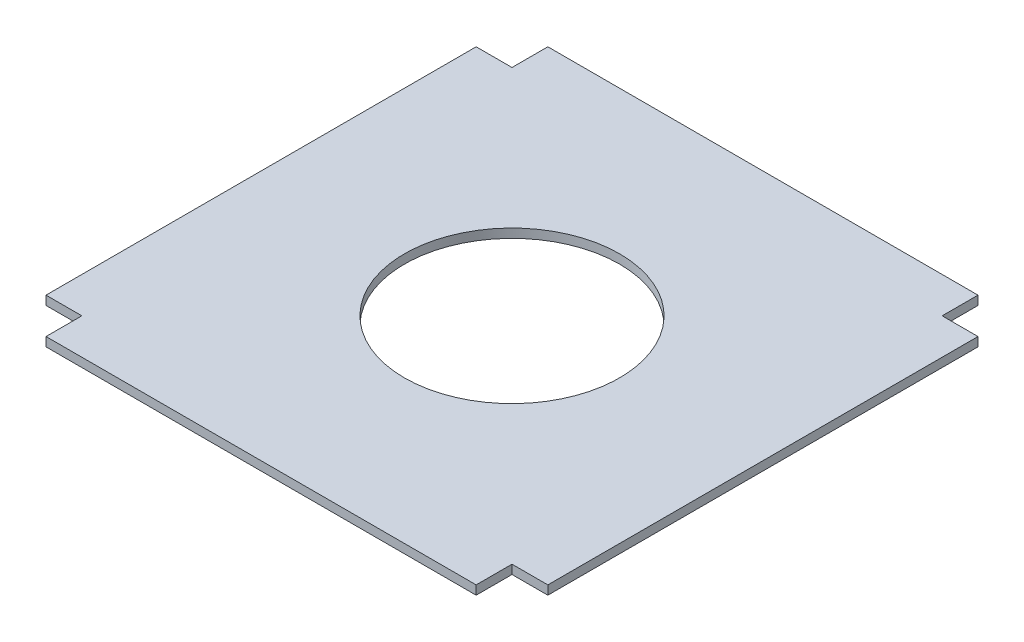
ISO-10303-21;
HEADER;
FILE_DESCRIPTION(('STEP AP214'),'2;1');
FILE_NAME('part.step','',(''),(''),'','','');
FILE_SCHEMA(('AUTOMOTIVE_DESIGN { 1 0 10303 214 1 1 1 1 }'));
ENDSEC;
DATA;
#1=APPLICATION_CONTEXT('core data for automotive mechanical design processes');
#2=APPLICATION_PROTOCOL_DEFINITION('international standard','automotive_design',2000,#1);
#3=PRODUCT_CONTEXT('',#1,'mechanical');
#4=PRODUCT('Part','Part','',(#3));
#5=PRODUCT_RELATED_PRODUCT_CATEGORY('part','',(#4));
#6=PRODUCT_DEFINITION_FORMATION('','',#4);
#7=PRODUCT_DEFINITION_CONTEXT('part definition',#1,'design');
#8=PRODUCT_DEFINITION('design','',#6,#7);
#9=PRODUCT_DEFINITION_SHAPE('','',#8);
#10=(LENGTH_UNIT() NAMED_UNIT(*) SI_UNIT(.MILLI.,.METRE.));
#11=(NAMED_UNIT(*) PLANE_ANGLE_UNIT() SI_UNIT($,.RADIAN.));
#12=(NAMED_UNIT(*) SI_UNIT($,.STERADIAN.) SOLID_ANGLE_UNIT());
#13=UNCERTAINTY_MEASURE_WITH_UNIT(LENGTH_MEASURE(1.E-05),#10,'distance_accuracy_value','');
#14=(GEOMETRIC_REPRESENTATION_CONTEXT(3) GLOBAL_UNCERTAINTY_ASSIGNED_CONTEXT((#13)) GLOBAL_UNIT_ASSIGNED_CONTEXT((#10,
#11,#12)) REPRESENTATION_CONTEXT('',''));
#15=CARTESIAN_POINT('',(0.,0.,0.));
#16=DIRECTION('',(0.,0.,1.));
#17=DIRECTION('',(1.,0.,0.));
#18=AXIS2_PLACEMENT_3D('',#15,#16,#17);
#19=CARTESIAN_POINT('',(0.,6.35,0.));
#20=DIRECTION('',(0.,1.,0.));
#21=DIRECTION('',(0.,0.,1.));
#22=AXIS2_PLACEMENT_3D('',#19,#20,#21);
#23=PLANE('',#22);
#24=DIRECTION('',(1.,0.,0.));
#25=VECTOR('',#24,1.);
#26=CARTESIAN_POINT('',(25.4,6.35,0.));
#27=LINE('',#26,#25);
#28=CARTESIAN_POINT('',(0.,6.35,0.));
#29=VERTEX_POINT('',#28);
#30=CARTESIAN_POINT('',(25.4,6.35,0.));
#31=VERTEX_POINT('',#30);
#32=EDGE_CURVE('E200',#29,#31,#27,.T.);
#33=ORIENTED_EDGE('',*,*,#32,.T.);
#34=DIRECTION('',(0.,0.,-1.));
#35=VECTOR('',#34,1.);
#36=CARTESIAN_POINT('',(25.4,6.35,-304.8));
#37=LINE('',#36,#35);
#38=CARTESIAN_POINT('',(25.4,6.35,-304.8));
#39=VERTEX_POINT('',#38);
#40=EDGE_CURVE('E112',#31,#39,#37,.T.);
#41=ORIENTED_EDGE('',*,*,#40,.T.);
#42=DIRECTION('',(-1.,0.,0.));
#43=VECTOR('',#42,1.);
#44=CARTESIAN_POINT('',(0.,6.35,-304.8));
#45=LINE('',#44,#43);
#46=CARTESIAN_POINT('',(0.,6.35,-304.8));
#47=VERTEX_POINT('',#46);
#48=EDGE_CURVE('E237',#39,#47,#45,.T.);
#49=ORIENTED_EDGE('',*,*,#48,.T.);
#50=DIRECTION('',(0.,0.,-1.));
#51=VECTOR('',#50,1.);
#52=CARTESIAN_POINT('',(0.,6.35,-330.2));
#53=LINE('',#52,#51);
#54=CARTESIAN_POINT('',(0.,6.35,-330.2));
#55=VERTEX_POINT('',#54);
#56=EDGE_CURVE('E257',#47,#55,#53,.T.);
#57=ORIENTED_EDGE('',*,*,#56,.T.);
#58=DIRECTION('',(-1.,0.,0.));
#59=VECTOR('',#58,1.);
#60=CARTESIAN_POINT('',(-304.8,6.35,-330.2));
#61=LINE('',#60,#59);
#62=CARTESIAN_POINT('',(-304.8,6.35,-330.2));
#63=VERTEX_POINT('',#62);
#64=EDGE_CURVE('E253',#55,#63,#61,.T.);
#65=ORIENTED_EDGE('',*,*,#64,.T.);
#66=DIRECTION('',(0.,0.,1.));
#67=VECTOR('',#66,1.);
#68=CARTESIAN_POINT('',(-304.8,6.35,-304.8));
#69=LINE('',#68,#67);
#70=CARTESIAN_POINT('',(-304.8,6.35,-304.8));
#71=VERTEX_POINT('',#70);
#72=EDGE_CURVE('E256',#63,#71,#69,.T.);
#73=ORIENTED_EDGE('',*,*,#72,.T.);
#74=DIRECTION('',(-1.,0.,0.));
#75=VECTOR('',#74,1.);
#76=CARTESIAN_POINT('',(-330.2,6.35,-304.8));
#77=LINE('',#76,#75);
#78=CARTESIAN_POINT('',(-330.2,6.35,-304.8));
#79=VERTEX_POINT('',#78);
#80=EDGE_CURVE('E261',#71,#79,#77,.T.);
#81=ORIENTED_EDGE('',*,*,#80,.T.);
#82=DIRECTION('',(0.,0.,1.));
#83=VECTOR('',#82,1.);
#84=CARTESIAN_POINT('',(-330.2,6.35,0.));
#85=LINE('',#84,#83);
#86=CARTESIAN_POINT('',(-330.2,6.35,0.));
#87=VERTEX_POINT('',#86);
#88=EDGE_CURVE('E268',#79,#87,#85,.T.);
#89=ORIENTED_EDGE('',*,*,#88,.T.);
#90=DIRECTION('',(1.,0.,0.));
#91=VECTOR('',#90,1.);
#92=CARTESIAN_POINT('',(-304.8,6.35,0.));
#93=LINE('',#92,#91);
#94=CARTESIAN_POINT('',(-304.8,6.35,0.));
#95=VERTEX_POINT('',#94);
#96=EDGE_CURVE('E143',#87,#95,#93,.T.);
#97=ORIENTED_EDGE('',*,*,#96,.T.);
#98=DIRECTION('',(0.,0.,1.));
#99=VECTOR('',#98,1.);
#100=CARTESIAN_POINT('',(-304.8,6.35,25.4));
#101=LINE('',#100,#99);
#102=CARTESIAN_POINT('',(-304.8,6.35,25.4));
#103=VERTEX_POINT('',#102);
#104=EDGE_CURVE('E137',#95,#103,#101,.T.);
#105=ORIENTED_EDGE('',*,*,#104,.T.);
#106=DIRECTION('',(1.,0.,0.));
#107=VECTOR('',#106,1.);
#108=CARTESIAN_POINT('',(0.,6.35,25.4));
#109=LINE('',#108,#107);
#110=CARTESIAN_POINT('',(0.,6.35,25.4));
#111=VERTEX_POINT('',#110);
#112=EDGE_CURVE('E141',#103,#111,#109,.T.);
#113=ORIENTED_EDGE('',*,*,#112,.T.);
#114=DIRECTION('',(0.,0.,-1.));
#115=VECTOR('',#114,1.);
#116=CARTESIAN_POINT('',(0.,6.35,0.));
#117=LINE('',#116,#115);
#118=EDGE_CURVE('E57',#111,#29,#117,.T.);
#119=ORIENTED_EDGE('',*,*,#118,.T.);
#120=EDGE_LOOP('',(#33,#41,#49,#57,#65,#73,#81,#89,#97,#105,#113,#119));
#121=FACE_BOUND('',#120,.T.);
#122=CARTESIAN_POINT('',(-152.4,6.35,-152.4));
#123=DIRECTION('',(0.,1.,0.));
#124=DIRECTION('',(0.,0.,1.));
#125=AXIS2_PLACEMENT_3D('',#122,#123,#124);
#126=CIRCLE('',#125,76.2);
#127=CARTESIAN_POINT('',(-152.4,6.35,-76.2));
#128=VERTEX_POINT('',#127);
#129=EDGE_CURVE('E170',#128,#128,#126,.T.);
#130=ORIENTED_EDGE('',*,*,#129,.F.);
#131=EDGE_LOOP('',(#130));
#132=FACE_BOUND('',#131,.T.);
#133=ADVANCED_FACE('F39',(#121,#132),#23,.T.);
#134=CARTESIAN_POINT('',(0.,0.,0.));
#135=DIRECTION('',(0.,1.,0.));
#136=DIRECTION('',(0.,0.,1.));
#137=AXIS2_PLACEMENT_3D('',#134,#135,#136);
#138=PLANE('',#137);
#139=DIRECTION('',(1.,0.,0.));
#140=VECTOR('',#139,1.);
#141=CARTESIAN_POINT('',(25.4,0.,0.));
#142=LINE('',#141,#140);
#143=CARTESIAN_POINT('',(0.,0.,0.));
#144=VERTEX_POINT('',#143);
#145=CARTESIAN_POINT('',(25.4,0.,0.));
#146=VERTEX_POINT('',#145);
#147=EDGE_CURVE('E165',#144,#146,#142,.T.);
#148=ORIENTED_EDGE('',*,*,#147,.F.);
#149=DIRECTION('',(0.,0.,-1.));
#150=VECTOR('',#149,1.);
#151=CARTESIAN_POINT('',(0.,0.,0.));
#152=LINE('',#151,#150);
#153=CARTESIAN_POINT('',(0.,0.,25.4));
#154=VERTEX_POINT('',#153);
#155=EDGE_CURVE('E104',#154,#144,#152,.T.);
#156=ORIENTED_EDGE('',*,*,#155,.F.);
#157=DIRECTION('',(1.,0.,0.));
#158=VECTOR('',#157,1.);
#159=CARTESIAN_POINT('',(0.,0.,25.4));
#160=LINE('',#159,#158);
#161=CARTESIAN_POINT('',(-304.8,0.,25.4));
#162=VERTEX_POINT('',#161);
#163=EDGE_CURVE('E98',#162,#154,#160,.T.);
#164=ORIENTED_EDGE('',*,*,#163,.F.);
#165=DIRECTION('',(0.,0.,1.));
#166=VECTOR('',#165,1.);
#167=CARTESIAN_POINT('',(-304.8,0.,25.4));
#168=LINE('',#167,#166);
#169=CARTESIAN_POINT('',(-304.8,0.,0.));
#170=VERTEX_POINT('',#169);
#171=EDGE_CURVE('E152',#170,#162,#168,.T.);
#172=ORIENTED_EDGE('',*,*,#171,.F.);
#173=DIRECTION('',(1.,0.,0.));
#174=VECTOR('',#173,1.);
#175=CARTESIAN_POINT('',(-304.8,0.,0.));
#176=LINE('',#175,#174);
#177=CARTESIAN_POINT('',(-330.2,0.,0.));
#178=VERTEX_POINT('',#177);
#179=EDGE_CURVE('E191',#178,#170,#176,.T.);
#180=ORIENTED_EDGE('',*,*,#179,.F.);
#181=DIRECTION('',(0.,0.,1.));
#182=VECTOR('',#181,1.);
#183=CARTESIAN_POINT('',(-330.2,0.,0.));
#184=LINE('',#183,#182);
#185=CARTESIAN_POINT('',(-330.2,0.,-304.8));
#186=VERTEX_POINT('',#185);
#187=EDGE_CURVE('E188',#186,#178,#184,.T.);
#188=ORIENTED_EDGE('',*,*,#187,.F.);
#189=DIRECTION('',(-1.,0.,0.));
#190=VECTOR('',#189,1.);
#191=CARTESIAN_POINT('',(-330.2,0.,-304.8));
#192=LINE('',#191,#190);
#193=CARTESIAN_POINT('',(-304.8,0.,-304.8));
#194=VERTEX_POINT('',#193);
#195=EDGE_CURVE('E185',#194,#186,#192,.T.);
#196=ORIENTED_EDGE('',*,*,#195,.F.);
#197=DIRECTION('',(0.,0.,1.));
#198=VECTOR('',#197,1.);
#199=CARTESIAN_POINT('',(-304.8,0.,-304.8));
#200=LINE('',#199,#198);
#201=CARTESIAN_POINT('',(-304.8,0.,-330.2));
#202=VERTEX_POINT('',#201);
#203=EDGE_CURVE('E182',#202,#194,#200,.T.);
#204=ORIENTED_EDGE('',*,*,#203,.F.);
#205=DIRECTION('',(-1.,0.,0.));
#206=VECTOR('',#205,1.);
#207=CARTESIAN_POINT('',(-304.8,0.,-330.2));
#208=LINE('',#207,#206);
#209=CARTESIAN_POINT('',(0.,0.,-330.2));
#210=VERTEX_POINT('',#209);
#211=EDGE_CURVE('E179',#210,#202,#208,.T.);
#212=ORIENTED_EDGE('',*,*,#211,.F.);
#213=DIRECTION('',(0.,0.,-1.));
#214=VECTOR('',#213,1.);
#215=CARTESIAN_POINT('',(0.,0.,-330.2));
#216=LINE('',#215,#214);
#217=CARTESIAN_POINT('',(0.,0.,-304.8));
#218=VERTEX_POINT('',#217);
#219=EDGE_CURVE('E176',#218,#210,#216,.T.);
#220=ORIENTED_EDGE('',*,*,#219,.F.);
#221=DIRECTION('',(-1.,0.,0.));
#222=VECTOR('',#221,1.);
#223=CARTESIAN_POINT('',(0.,0.,-304.8));
#224=LINE('',#223,#222);
#225=CARTESIAN_POINT('',(25.4,0.,-304.8));
#226=VERTEX_POINT('',#225);
#227=EDGE_CURVE('E173',#226,#218,#224,.T.);
#228=ORIENTED_EDGE('',*,*,#227,.F.);
#229=DIRECTION('',(0.,0.,-1.));
#230=VECTOR('',#229,1.);
#231=CARTESIAN_POINT('',(25.4,0.,-304.8));
#232=LINE('',#231,#230);
#233=EDGE_CURVE('E169',#146,#226,#232,.T.);
#234=ORIENTED_EDGE('',*,*,#233,.F.);
#235=EDGE_LOOP('',(#148,#156,#164,#172,#180,#188,#196,#204,#212,#220,#228,#234));
#236=FACE_BOUND('',#235,.T.);
#237=CARTESIAN_POINT('',(-152.4,0.,-152.4));
#238=DIRECTION('',(0.,1.,0.));
#239=DIRECTION('',(0.,0.,1.));
#240=AXIS2_PLACEMENT_3D('',#237,#238,#239);
#241=CIRCLE('',#240,76.2);
#242=CARTESIAN_POINT('',(-152.4,0.,-76.2));
#243=VERTEX_POINT('',#242);
#244=EDGE_CURVE('E417',#243,#243,#241,.T.);
#245=ORIENTED_EDGE('',*,*,#244,.T.);
#246=EDGE_LOOP('',(#245));
#247=FACE_BOUND('',#246,.T.);
#248=ADVANCED_FACE('F241',(#236,#247),#138,.F.);
#249=CARTESIAN_POINT('',(25.4,6.35,0.));
#250=DIRECTION('',(0.,0.,-1.));
#251=DIRECTION('',(-1.,0.,0.));
#252=AXIS2_PLACEMENT_3D('',#249,#250,#251);
#253=PLANE('',#252);
#254=ORIENTED_EDGE('',*,*,#147,.T.);
#255=DIRECTION('',(0.,-1.,0.));
#256=VECTOR('',#255,1.);
#257=CARTESIAN_POINT('',(25.4,6.35,0.));
#258=LINE('',#257,#256);
#259=EDGE_CURVE('E11',#31,#146,#258,.T.);
#260=ORIENTED_EDGE('',*,*,#259,.F.);
#261=ORIENTED_EDGE('',*,*,#32,.F.);
#262=DIRECTION('',(0.,-1.,0.));
#263=VECTOR('',#262,1.);
#264=CARTESIAN_POINT('',(0.,6.35,0.));
#265=LINE('',#264,#263);
#266=EDGE_CURVE('E161',#29,#144,#265,.T.);
#267=ORIENTED_EDGE('',*,*,#266,.T.);
#268=EDGE_LOOP('',(#254,#260,#261,#267));
#269=FACE_BOUND('',#268,.T.);
#270=ADVANCED_FACE('F41',(#269),#253,.F.);
#271=CARTESIAN_POINT('',(25.4,6.35,-304.8));
#272=DIRECTION('',(-1.,0.,0.));
#273=DIRECTION('',(0.,0.,1.));
#274=AXIS2_PLACEMENT_3D('',#271,#272,#273);
#275=PLANE('',#274);
#276=ORIENTED_EDGE('',*,*,#233,.T.);
#277=DIRECTION('',(0.,-1.,0.));
#278=VECTOR('',#277,1.);
#279=CARTESIAN_POINT('',(25.4,6.35,-304.8));
#280=LINE('',#279,#278);
#281=EDGE_CURVE('E49',#39,#226,#280,.T.);
#282=ORIENTED_EDGE('',*,*,#281,.F.);
#283=ORIENTED_EDGE('',*,*,#40,.F.);
#284=ORIENTED_EDGE('',*,*,#259,.T.);
#285=EDGE_LOOP('',(#276,#282,#283,#284));
#286=FACE_BOUND('',#285,.T.);
#287=ADVANCED_FACE('F304',(#286),#275,.F.);
#288=CARTESIAN_POINT('',(0.,6.35,-304.8));
#289=DIRECTION('',(0.,0.,1.));
#290=DIRECTION('',(1.,0.,0.));
#291=AXIS2_PLACEMENT_3D('',#288,#289,#290);
#292=PLANE('',#291);
#293=ORIENTED_EDGE('',*,*,#227,.T.);
#294=DIRECTION('',(0.,-1.,0.));
#295=VECTOR('',#294,1.);
#296=CARTESIAN_POINT('',(0.,6.35,-304.8));
#297=LINE('',#296,#295);
#298=EDGE_CURVE('E227',#47,#218,#297,.T.);
#299=ORIENTED_EDGE('',*,*,#298,.F.);
#300=ORIENTED_EDGE('',*,*,#48,.F.);
#301=ORIENTED_EDGE('',*,*,#281,.T.);
#302=EDGE_LOOP('',(#293,#299,#300,#301));
#303=FACE_BOUND('',#302,.T.);
#304=ADVANCED_FACE('F235',(#303),#292,.F.);
#305=CARTESIAN_POINT('',(0.,6.35,-330.2));
#306=DIRECTION('',(-1.,0.,0.));
#307=DIRECTION('',(0.,0.,1.));
#308=AXIS2_PLACEMENT_3D('',#305,#306,#307);
#309=PLANE('',#308);
#310=ORIENTED_EDGE('',*,*,#219,.T.);
#311=DIRECTION('',(0.,-1.,0.));
#312=VECTOR('',#311,1.);
#313=CARTESIAN_POINT('',(0.,6.35,-330.2));
#314=LINE('',#313,#312);
#315=EDGE_CURVE('E223',#55,#210,#314,.T.);
#316=ORIENTED_EDGE('',*,*,#315,.F.);
#317=ORIENTED_EDGE('',*,*,#56,.F.);
#318=ORIENTED_EDGE('',*,*,#298,.T.);
#319=EDGE_LOOP('',(#310,#316,#317,#318));
#320=FACE_BOUND('',#319,.T.);
#321=ADVANCED_FACE('F247',(#320),#309,.F.);
#322=CARTESIAN_POINT('',(-304.8,6.35,-330.2));
#323=DIRECTION('',(0.,0.,1.));
#324=DIRECTION('',(1.,0.,0.));
#325=AXIS2_PLACEMENT_3D('',#322,#323,#324);
#326=PLANE('',#325);
#327=ORIENTED_EDGE('',*,*,#211,.T.);
#328=DIRECTION('',(0.,-1.,0.));
#329=VECTOR('',#328,1.);
#330=CARTESIAN_POINT('',(-304.8,6.35,-330.2));
#331=LINE('',#330,#329);
#332=EDGE_CURVE('E219',#63,#202,#331,.T.);
#333=ORIENTED_EDGE('',*,*,#332,.F.);
#334=ORIENTED_EDGE('',*,*,#64,.F.);
#335=ORIENTED_EDGE('',*,*,#315,.T.);
#336=EDGE_LOOP('',(#327,#333,#334,#335));
#337=FACE_BOUND('',#336,.T.);
#338=ADVANCED_FACE('F251',(#337),#326,.F.);
#339=CARTESIAN_POINT('',(-304.8,6.35,-304.8));
#340=DIRECTION('',(1.,0.,0.));
#341=DIRECTION('',(0.,0.,-1.));
#342=AXIS2_PLACEMENT_3D('',#339,#340,#341);
#343=PLANE('',#342);
#344=ORIENTED_EDGE('',*,*,#203,.T.);
#345=DIRECTION('',(0.,-1.,0.));
#346=VECTOR('',#345,1.);
#347=CARTESIAN_POINT('',(-304.8,6.35,-304.8));
#348=LINE('',#347,#346);
#349=EDGE_CURVE('E215',#71,#194,#348,.T.);
#350=ORIENTED_EDGE('',*,*,#349,.F.);
#351=ORIENTED_EDGE('',*,*,#72,.F.);
#352=ORIENTED_EDGE('',*,*,#332,.T.);
#353=EDGE_LOOP('',(#344,#350,#351,#352));
#354=FACE_BOUND('',#353,.T.);
#355=ADVANCED_FACE('F317',(#354),#343,.F.);
#356=CARTESIAN_POINT('',(-330.2,6.35,-304.8));
#357=DIRECTION('',(0.,0.,1.));
#358=DIRECTION('',(1.,0.,0.));
#359=AXIS2_PLACEMENT_3D('',#356,#357,#358);
#360=PLANE('',#359);
#361=ORIENTED_EDGE('',*,*,#195,.T.);
#362=DIRECTION('',(0.,-1.,0.));
#363=VECTOR('',#362,1.);
#364=CARTESIAN_POINT('',(-330.2,6.35,-304.8));
#365=LINE('',#364,#363);
#366=EDGE_CURVE('E211',#79,#186,#365,.T.);
#367=ORIENTED_EDGE('',*,*,#366,.F.);
#368=ORIENTED_EDGE('',*,*,#80,.F.);
#369=ORIENTED_EDGE('',*,*,#349,.T.);
#370=EDGE_LOOP('',(#361,#367,#368,#369));
#371=FACE_BOUND('',#370,.T.);
#372=ADVANCED_FACE('F320',(#371),#360,.F.);
#373=CARTESIAN_POINT('',(-330.2,6.35,0.));
#374=DIRECTION('',(1.,0.,0.));
#375=DIRECTION('',(0.,0.,-1.));
#376=AXIS2_PLACEMENT_3D('',#373,#374,#375);
#377=PLANE('',#376);
#378=ORIENTED_EDGE('',*,*,#187,.T.);
#379=DIRECTION('',(0.,-1.,0.));
#380=VECTOR('',#379,1.);
#381=CARTESIAN_POINT('',(-330.2,6.35,0.));
#382=LINE('',#381,#380);
#383=EDGE_CURVE('E207',#87,#178,#382,.T.);
#384=ORIENTED_EDGE('',*,*,#383,.F.);
#385=ORIENTED_EDGE('',*,*,#88,.F.);
#386=ORIENTED_EDGE('',*,*,#366,.T.);
#387=EDGE_LOOP('',(#378,#384,#385,#386));
#388=FACE_BOUND('',#387,.T.);
#389=ADVANCED_FACE('F276',(#388),#377,.F.);
#390=CARTESIAN_POINT('',(-304.8,6.35,0.));
#391=DIRECTION('',(0.,0.,-1.));
#392=DIRECTION('',(-1.,0.,0.));
#393=AXIS2_PLACEMENT_3D('',#390,#391,#392);
#394=PLANE('',#393);
#395=ORIENTED_EDGE('',*,*,#179,.T.);
#396=DIRECTION('',(0.,-1.,0.));
#397=VECTOR('',#396,1.);
#398=CARTESIAN_POINT('',(-304.8,6.35,0.));
#399=LINE('',#398,#397);
#400=EDGE_CURVE('E154',#95,#170,#399,.T.);
#401=ORIENTED_EDGE('',*,*,#400,.F.);
#402=ORIENTED_EDGE('',*,*,#96,.F.);
#403=ORIENTED_EDGE('',*,*,#383,.T.);
#404=EDGE_LOOP('',(#395,#401,#402,#403));
#405=FACE_BOUND('',#404,.T.);
#406=ADVANCED_FACE('F280',(#405),#394,.F.);
#407=CARTESIAN_POINT('',(-304.8,6.35,25.4));
#408=DIRECTION('',(1.,0.,0.));
#409=DIRECTION('',(0.,0.,-1.));
#410=AXIS2_PLACEMENT_3D('',#407,#408,#409);
#411=PLANE('',#410);
#412=ORIENTED_EDGE('',*,*,#171,.T.);
#413=DIRECTION('',(0.,-1.,0.));
#414=VECTOR('',#413,1.);
#415=CARTESIAN_POINT('',(-304.8,6.35,25.4));
#416=LINE('',#415,#414);
#417=EDGE_CURVE('E149',#103,#162,#416,.T.);
#418=ORIENTED_EDGE('',*,*,#417,.F.);
#419=ORIENTED_EDGE('',*,*,#104,.F.);
#420=ORIENTED_EDGE('',*,*,#400,.T.);
#421=EDGE_LOOP('',(#412,#418,#419,#420));
#422=FACE_BOUND('',#421,.T.);
#423=ADVANCED_FACE('F150',(#422),#411,.F.);
#424=CARTESIAN_POINT('',(0.,6.35,25.4));
#425=DIRECTION('',(0.,0.,-1.));
#426=DIRECTION('',(-1.,0.,0.));
#427=AXIS2_PLACEMENT_3D('',#424,#425,#426);
#428=PLANE('',#427);
#429=ORIENTED_EDGE('',*,*,#163,.T.);
#430=DIRECTION('',(0.,-1.,0.));
#431=VECTOR('',#430,1.);
#432=CARTESIAN_POINT('',(0.,6.35,25.4));
#433=LINE('',#432,#431);
#434=EDGE_CURVE('E155',#111,#154,#433,.T.);
#435=ORIENTED_EDGE('',*,*,#434,.F.);
#436=ORIENTED_EDGE('',*,*,#112,.F.);
#437=ORIENTED_EDGE('',*,*,#417,.T.);
#438=EDGE_LOOP('',(#429,#435,#436,#437));
#439=FACE_BOUND('',#438,.T.);
#440=ADVANCED_FACE('F157',(#439),#428,.F.);
#441=CARTESIAN_POINT('',(0.,6.35,0.));
#442=DIRECTION('',(-1.,0.,0.));
#443=DIRECTION('',(0.,0.,1.));
#444=AXIS2_PLACEMENT_3D('',#441,#442,#443);
#445=PLANE('',#444);
#446=ORIENTED_EDGE('',*,*,#155,.T.);
#447=ORIENTED_EDGE('',*,*,#266,.F.);
#448=ORIENTED_EDGE('',*,*,#118,.F.);
#449=ORIENTED_EDGE('',*,*,#434,.T.);
#450=EDGE_LOOP('',(#446,#447,#448,#449));
#451=FACE_BOUND('',#450,.T.);
#452=ADVANCED_FACE('F284',(#451),#445,.F.);
#453=CARTESIAN_POINT('',(-152.4,6.35,-152.4));
#454=DIRECTION('',(0.,-1.,0.));
#455=DIRECTION('',(0.,0.,-1.));
#456=AXIS2_PLACEMENT_3D('',#453,#454,#455);
#457=CYLINDRICAL_SURFACE('',#456,76.2);
#458=ORIENTED_EDGE('',*,*,#129,.T.);
#459=EDGE_LOOP('',(#458));
#460=FACE_BOUND('',#459,.T.);
#461=ORIENTED_EDGE('',*,*,#244,.F.);
#462=EDGE_LOOP('',(#461));
#463=FACE_BOUND('',#462,.T.);
#464=ADVANCED_FACE('F286',(#460,#463),#457,.F.);
#465=CLOSED_SHELL('',(#133,#248,#270,#287,#304,#321,#338,#355,#372,#389,#406,#423,#440,#452,#464));
#466=MANIFOLD_SOLID_BREP('B2',#465);
#467=ADVANCED_BREP_SHAPE_REPRESENTATION('',(#18,#466),#14);
#468=SHAPE_DEFINITION_REPRESENTATION(#9,#467);
ENDSEC;
END-ISO-10303-21;
